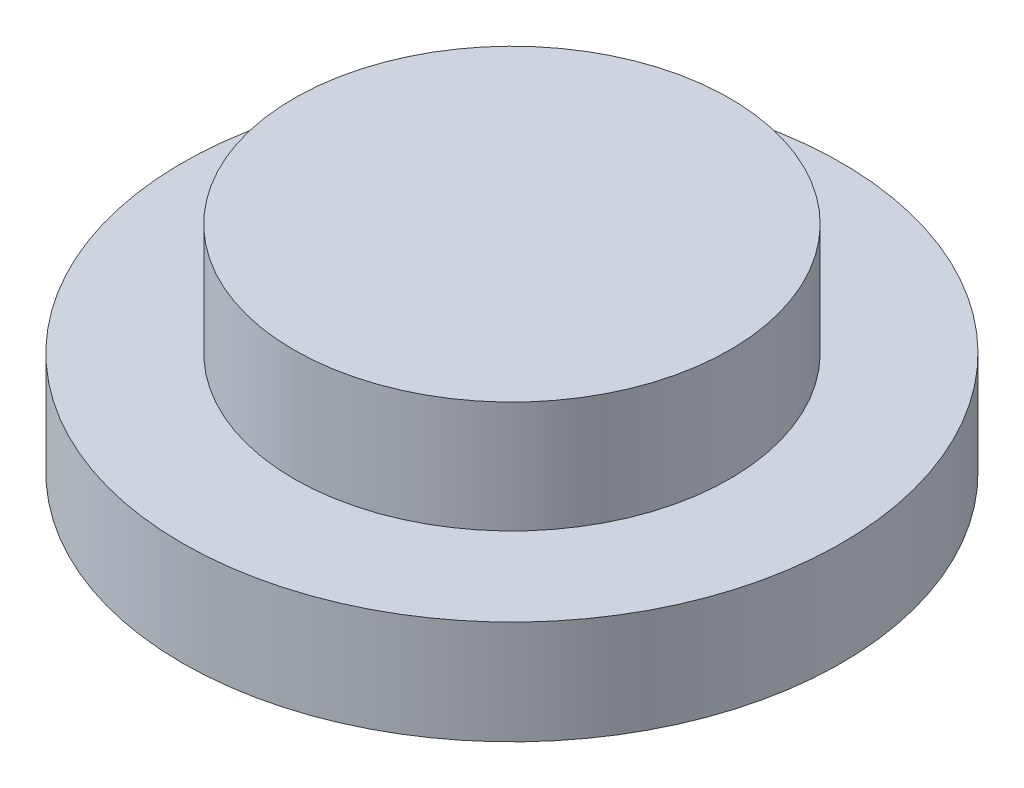
ISO-10303-21;
HEADER;
FILE_DESCRIPTION(('STEP AP214'),'2;1');
FILE_NAME('part.step','',(''),(''),'','','');
FILE_SCHEMA(('AUTOMOTIVE_DESIGN { 1 0 10303 214 1 1 1 1 }'));
ENDSEC;
DATA;
#1=APPLICATION_CONTEXT('core data for automotive mechanical design processes');
#2=APPLICATION_PROTOCOL_DEFINITION('international standard','automotive_design',2000,#1);
#3=PRODUCT_CONTEXT('',#1,'mechanical');
#4=PRODUCT('Part','Part','',(#3));
#5=PRODUCT_RELATED_PRODUCT_CATEGORY('part','',(#4));
#6=PRODUCT_DEFINITION_FORMATION('','',#4);
#7=PRODUCT_DEFINITION_CONTEXT('part definition',#1,'design');
#8=PRODUCT_DEFINITION('design','',#6,#7);
#9=PRODUCT_DEFINITION_SHAPE('','',#8);
#10=(LENGTH_UNIT() NAMED_UNIT(*) SI_UNIT(.MILLI.,.METRE.));
#11=(NAMED_UNIT(*) PLANE_ANGLE_UNIT() SI_UNIT($,.RADIAN.));
#12=(NAMED_UNIT(*) SI_UNIT($,.STERADIAN.) SOLID_ANGLE_UNIT());
#13=UNCERTAINTY_MEASURE_WITH_UNIT(LENGTH_MEASURE(1.E-05),#10,'distance_accuracy_value','');
#14=(GEOMETRIC_REPRESENTATION_CONTEXT(3) GLOBAL_UNCERTAINTY_ASSIGNED_CONTEXT((#13)) GLOBAL_UNIT_ASSIGNED_CONTEXT((#10,
#11,#12)) REPRESENTATION_CONTEXT('',''));
#15=CARTESIAN_POINT('',(0.,0.,0.));
#16=DIRECTION('',(0.,0.,1.));
#17=DIRECTION('',(1.,0.,0.));
#18=AXIS2_PLACEMENT_3D('',#15,#16,#17);
#19=CARTESIAN_POINT('',(0.,2.9972,0.));
#20=DIRECTION('',(0.,-1.,0.));
#21=DIRECTION('',(0.,0.,-1.));
#22=AXIS2_PLACEMENT_3D('',#19,#20,#21);
#23=CYLINDRICAL_SURFACE('',#22,9.52500000000001);
#24=CARTESIAN_POINT('',(0.,2.9972,0.));
#25=DIRECTION('',(0.,1.,0.));
#26=DIRECTION('',(0.,0.,1.));
#27=AXIS2_PLACEMENT_3D('',#24,#25,#26);
#28=CIRCLE('',#27,9.52500000000001);
#29=CARTESIAN_POINT('',(0.,2.9972,9.52500000000001));
#30=VERTEX_POINT('',#29);
#31=EDGE_CURVE('E45',#30,#30,#28,.T.);
#32=ORIENTED_EDGE('',*,*,#31,.F.);
#33=EDGE_LOOP('',(#32));
#34=FACE_BOUND('',#33,.T.);
#35=CARTESIAN_POINT('',(0.,0.,0.));
#36=DIRECTION('',(0.,1.,0.));
#37=DIRECTION('',(0.,0.,1.));
#38=AXIS2_PLACEMENT_3D('',#35,#36,#37);
#39=CIRCLE('',#38,9.52500000000001);
#40=CARTESIAN_POINT('',(0.,0.,9.52500000000001));
#41=VERTEX_POINT('',#40);
#42=EDGE_CURVE('E40',#41,#41,#39,.T.);
#43=ORIENTED_EDGE('',*,*,#42,.T.);
#44=EDGE_LOOP('',(#43));
#45=FACE_BOUND('',#44,.T.);
#46=ADVANCED_FACE('F37',(#34,#45),#23,.T.);
#47=CARTESIAN_POINT('',(0.,2.9972,0.));
#48=DIRECTION('',(0.,1.,0.));
#49=DIRECTION('',(0.,0.,1.));
#50=AXIS2_PLACEMENT_3D('',#47,#48,#49);
#51=PLANE('',#50);
#52=CARTESIAN_POINT('',(0.,2.9972,0.));
#53=DIRECTION('',(0.,1.,0.));
#54=DIRECTION('',(0.,0.,1.));
#55=AXIS2_PLACEMENT_3D('',#52,#53,#54);
#56=CIRCLE('',#55,6.2992);
#57=CARTESIAN_POINT('',(0.,2.9972,6.2992));
#58=VERTEX_POINT('',#57);
#59=EDGE_CURVE('E10',#58,#58,#56,.T.);
#60=ORIENTED_EDGE('',*,*,#59,.F.);
#61=EDGE_LOOP('',(#60));
#62=FACE_BOUND('',#61,.T.);
#63=ORIENTED_EDGE('',*,*,#31,.T.);
#64=EDGE_LOOP('',(#63));
#65=FACE_BOUND('',#64,.T.);
#66=ADVANCED_FACE('F65',(#62,#65),#51,.T.);
#67=CARTESIAN_POINT('',(0.,0.,0.));
#68=DIRECTION('',(0.,1.,0.));
#69=DIRECTION('',(0.,0.,1.));
#70=AXIS2_PLACEMENT_3D('',#67,#68,#69);
#71=PLANE('',#70);
#72=ORIENTED_EDGE('',*,*,#42,.F.);
#73=EDGE_LOOP('',(#72));
#74=FACE_BOUND('',#73,.T.);
#75=ADVANCED_FACE('F62',(#74),#71,.F.);
#76=CARTESIAN_POINT('',(0.,6.223,0.));
#77=DIRECTION('',(0.,-1.,0.));
#78=DIRECTION('',(0.,0.,-1.));
#79=AXIS2_PLACEMENT_3D('',#76,#77,#78);
#80=CYLINDRICAL_SURFACE('',#79,6.2992);
#81=CARTESIAN_POINT('',(0.,6.223,0.));
#82=DIRECTION('',(0.,1.,0.));
#83=DIRECTION('',(0.,0.,1.));
#84=AXIS2_PLACEMENT_3D('',#81,#82,#83);
#85=CIRCLE('',#84,6.2992);
#86=CARTESIAN_POINT('',(0.,6.223,6.2992));
#87=VERTEX_POINT('',#86);
#88=EDGE_CURVE('E52',#87,#87,#85,.T.);
#89=ORIENTED_EDGE('',*,*,#88,.F.);
#90=EDGE_LOOP('',(#89));
#91=FACE_BOUND('',#90,.T.);
#92=ORIENTED_EDGE('',*,*,#59,.T.);
#93=EDGE_LOOP('',(#92));
#94=FACE_BOUND('',#93,.T.);
#95=ADVANCED_FACE('F64',(#91,#94),#80,.T.);
#96=CARTESIAN_POINT('',(0.,6.223,0.));
#97=DIRECTION('',(0.,1.,0.));
#98=DIRECTION('',(0.,0.,1.));
#99=AXIS2_PLACEMENT_3D('',#96,#97,#98);
#100=PLANE('',#99);
#101=ORIENTED_EDGE('',*,*,#88,.T.);
#102=EDGE_LOOP('',(#101));
#103=FACE_BOUND('',#102,.T.);
#104=ADVANCED_FACE('F70',(#103),#100,.T.);
#105=CLOSED_SHELL('',(#46,#66,#75,#95,#104));
#106=MANIFOLD_SOLID_BREP('B2',#105);
#107=ADVANCED_BREP_SHAPE_REPRESENTATION('',(#18,#106),#14);
#108=SHAPE_DEFINITION_REPRESENTATION(#9,#107);
ENDSEC;
END-ISO-10303-21;
